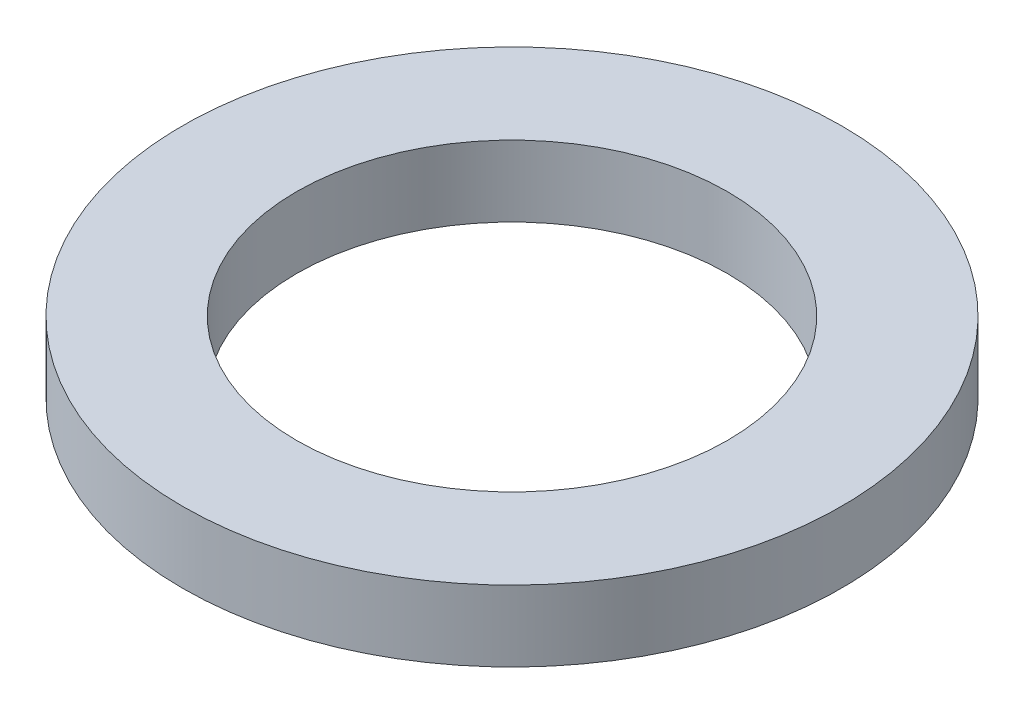
ISO-10303-21;
HEADER;
FILE_DESCRIPTION(('STEP AP214'),'2;1');
FILE_NAME('part.step','',(''),(''),'','','');
FILE_SCHEMA(('AUTOMOTIVE_DESIGN { 1 0 10303 214 1 1 1 1 }'));
ENDSEC;
DATA;
#1=APPLICATION_CONTEXT('core data for automotive mechanical design processes');
#2=APPLICATION_PROTOCOL_DEFINITION('international standard','automotive_design',2000,#1);
#3=PRODUCT_CONTEXT('',#1,'mechanical');
#4=PRODUCT('Part','Part','',(#3));
#5=PRODUCT_RELATED_PRODUCT_CATEGORY('part','',(#4));
#6=PRODUCT_DEFINITION_FORMATION('','',#4);
#7=PRODUCT_DEFINITION_CONTEXT('part definition',#1,'design');
#8=PRODUCT_DEFINITION('design','',#6,#7);
#9=PRODUCT_DEFINITION_SHAPE('','',#8);
#10=(LENGTH_UNIT() NAMED_UNIT(*) SI_UNIT(.MILLI.,.METRE.));
#11=(NAMED_UNIT(*) PLANE_ANGLE_UNIT() SI_UNIT($,.RADIAN.));
#12=(NAMED_UNIT(*) SI_UNIT($,.STERADIAN.) SOLID_ANGLE_UNIT());
#13=UNCERTAINTY_MEASURE_WITH_UNIT(LENGTH_MEASURE(1.E-05),#10,'distance_accuracy_value','');
#14=(GEOMETRIC_REPRESENTATION_CONTEXT(3) GLOBAL_UNCERTAINTY_ASSIGNED_CONTEXT((#13)) GLOBAL_UNIT_ASSIGNED_CONTEXT((#10,
#11,#12)) REPRESENTATION_CONTEXT('',''));
#15=CARTESIAN_POINT('',(0.,0.,0.));
#16=DIRECTION('',(0.,0.,1.));
#17=DIRECTION('',(1.,0.,0.));
#18=AXIS2_PLACEMENT_3D('',#15,#16,#17);
#19=CARTESIAN_POINT('',(0.,14.,0.));
#20=DIRECTION('',(0.,-1.,0.));
#21=DIRECTION('',(0.,0.,-1.));
#22=AXIS2_PLACEMENT_3D('',#19,#20,#21);
#23=CYLINDRICAL_SURFACE('',#22,65.);
#24=CARTESIAN_POINT('',(0.,14.,0.));
#25=DIRECTION('',(0.,1.,0.));
#26=DIRECTION('',(0.,0.,1.));
#27=AXIS2_PLACEMENT_3D('',#24,#25,#26);
#28=CIRCLE('',#27,65.);
#29=CARTESIAN_POINT('',(0.,14.,65.));
#30=VERTEX_POINT('',#29);
#31=EDGE_CURVE('E10',#30,#30,#28,.T.);
#32=ORIENTED_EDGE('',*,*,#31,.F.);
#33=EDGE_LOOP('',(#32));
#34=FACE_BOUND('',#33,.T.);
#35=CARTESIAN_POINT('',(0.,0.,0.));
#36=DIRECTION('',(0.,1.,0.));
#37=DIRECTION('',(0.,0.,1.));
#38=AXIS2_PLACEMENT_3D('',#35,#36,#37);
#39=CIRCLE('',#38,65.);
#40=CARTESIAN_POINT('',(0.,0.,65.));
#41=VERTEX_POINT('',#40);
#42=EDGE_CURVE('E37',#41,#41,#39,.T.);
#43=ORIENTED_EDGE('',*,*,#42,.T.);
#44=EDGE_LOOP('',(#43));
#45=FACE_BOUND('',#44,.T.);
#46=ADVANCED_FACE('F40',(#34,#45),#23,.T.);
#47=CARTESIAN_POINT('',(0.,14.,0.));
#48=DIRECTION('',(0.,1.,0.));
#49=DIRECTION('',(0.,0.,1.));
#50=AXIS2_PLACEMENT_3D('',#47,#48,#49);
#51=PLANE('',#50);
#52=CARTESIAN_POINT('',(0.,14.,0.));
#53=DIRECTION('',(0.,1.,0.));
#54=DIRECTION('',(0.,0.,1.));
#55=AXIS2_PLACEMENT_3D('',#52,#53,#54);
#56=CIRCLE('',#55,42.5);
#57=CARTESIAN_POINT('',(0.,14.,42.5));
#58=VERTEX_POINT('',#57);
#59=EDGE_CURVE('E50',#58,#58,#56,.T.);
#60=ORIENTED_EDGE('',*,*,#59,.F.);
#61=EDGE_LOOP('',(#60));
#62=FACE_BOUND('',#61,.T.);
#63=ORIENTED_EDGE('',*,*,#31,.T.);
#64=EDGE_LOOP('',(#63));
#65=FACE_BOUND('',#64,.T.);
#66=ADVANCED_FACE('F59',(#62,#65),#51,.T.);
#67=CARTESIAN_POINT('',(0.,0.,0.));
#68=DIRECTION('',(0.,1.,0.));
#69=DIRECTION('',(0.,0.,1.));
#70=AXIS2_PLACEMENT_3D('',#67,#68,#69);
#71=PLANE('',#70);
#72=CARTESIAN_POINT('',(0.,0.,0.));
#73=DIRECTION('',(0.,1.,0.));
#74=DIRECTION('',(0.,0.,1.));
#75=AXIS2_PLACEMENT_3D('',#72,#73,#74);
#76=CIRCLE('',#75,42.5);
#77=CARTESIAN_POINT('',(0.,0.,42.5));
#78=VERTEX_POINT('',#77);
#79=EDGE_CURVE('E47',#78,#78,#76,.T.);
#80=ORIENTED_EDGE('',*,*,#79,.T.);
#81=EDGE_LOOP('',(#80));
#82=FACE_BOUND('',#81,.T.);
#83=ORIENTED_EDGE('',*,*,#42,.F.);
#84=EDGE_LOOP('',(#83));
#85=FACE_BOUND('',#84,.T.);
#86=ADVANCED_FACE('F58',(#82,#85),#71,.F.);
#87=CARTESIAN_POINT('',(0.,14.,0.));
#88=DIRECTION('',(0.,-1.,0.));
#89=DIRECTION('',(0.,0.,-1.));
#90=AXIS2_PLACEMENT_3D('',#87,#88,#89);
#91=CYLINDRICAL_SURFACE('',#90,42.5);
#92=ORIENTED_EDGE('',*,*,#59,.T.);
#93=EDGE_LOOP('',(#92));
#94=FACE_BOUND('',#93,.T.);
#95=ORIENTED_EDGE('',*,*,#79,.F.);
#96=EDGE_LOOP('',(#95));
#97=FACE_BOUND('',#96,.T.);
#98=ADVANCED_FACE('F54',(#94,#97),#91,.F.);
#99=CLOSED_SHELL('',(#46,#66,#86,#98));
#100=MANIFOLD_SOLID_BREP('B2',#99);
#101=ADVANCED_BREP_SHAPE_REPRESENTATION('',(#18,#100),#14);
#102=SHAPE_DEFINITION_REPRESENTATION(#9,#101);
ENDSEC;
END-ISO-10303-21;
